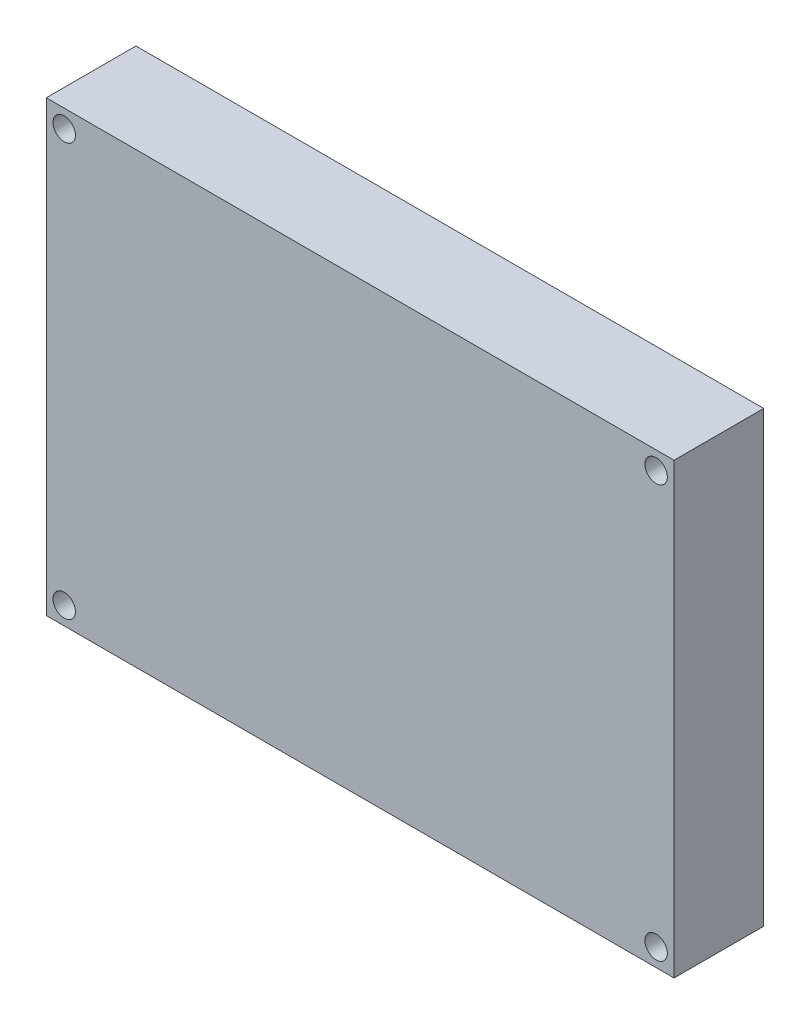
ISO-10303-21;
HEADER;
FILE_DESCRIPTION(('STEP AP214'),'2;1');
FILE_NAME('part.step','',(''),(''),'','','');
FILE_SCHEMA(('AUTOMOTIVE_DESIGN { 1 0 10303 214 1 1 1 1 }'));
ENDSEC;
DATA;
#1=APPLICATION_CONTEXT('core data for automotive mechanical design processes');
#2=APPLICATION_PROTOCOL_DEFINITION('international standard','automotive_design',2000,#1);
#3=PRODUCT_CONTEXT('',#1,'mechanical');
#4=PRODUCT('Part','Part','',(#3));
#5=PRODUCT_RELATED_PRODUCT_CATEGORY('part','',(#4));
#6=PRODUCT_DEFINITION_FORMATION('','',#4);
#7=PRODUCT_DEFINITION_CONTEXT('part definition',#1,'design');
#8=PRODUCT_DEFINITION('design','',#6,#7);
#9=PRODUCT_DEFINITION_SHAPE('','',#8);
#10=(LENGTH_UNIT() NAMED_UNIT(*) SI_UNIT(.MILLI.,.METRE.));
#11=(NAMED_UNIT(*) PLANE_ANGLE_UNIT() SI_UNIT($,.RADIAN.));
#12=(NAMED_UNIT(*) SI_UNIT($,.STERADIAN.) SOLID_ANGLE_UNIT());
#13=UNCERTAINTY_MEASURE_WITH_UNIT(LENGTH_MEASURE(1.E-05),#10,'distance_accuracy_value','');
#14=(GEOMETRIC_REPRESENTATION_CONTEXT(3) GLOBAL_UNCERTAINTY_ASSIGNED_CONTEXT((#13)) GLOBAL_UNIT_ASSIGNED_CONTEXT((#10,
#11,#12)) REPRESENTATION_CONTEXT('',''));
#15=CARTESIAN_POINT('',(0.,0.,0.));
#16=DIRECTION('',(0.,0.,1.));
#17=DIRECTION('',(1.,0.,0.));
#18=AXIS2_PLACEMENT_3D('',#15,#16,#17);
#19=CARTESIAN_POINT('',(35.,25.,10.));
#20=DIRECTION('',(-1.,0.,0.));
#21=DIRECTION('',(0.,0.,1.));
#22=AXIS2_PLACEMENT_3D('',#19,#20,#21);
#23=PLANE('',#22);
#24=DIRECTION('',(0.,1.,0.));
#25=VECTOR('',#24,1.);
#26=CARTESIAN_POINT('',(35.,25.,0.));
#27=LINE('',#26,#25);
#28=CARTESIAN_POINT('',(35.,-25.,0.));
#29=VERTEX_POINT('',#28);
#30=CARTESIAN_POINT('',(35.,25.,0.));
#31=VERTEX_POINT('',#30);
#32=EDGE_CURVE('E98',#29,#31,#27,.T.);
#33=ORIENTED_EDGE('',*,*,#32,.T.);
#34=DIRECTION('',(0.,0.,-1.));
#35=VECTOR('',#34,1.);
#36=CARTESIAN_POINT('',(35.,25.,10.));
#37=LINE('',#36,#35);
#38=CARTESIAN_POINT('',(35.,25.,10.));
#39=VERTEX_POINT('',#38);
#40=EDGE_CURVE('E11',#39,#31,#37,.T.);
#41=ORIENTED_EDGE('',*,*,#40,.F.);
#42=DIRECTION('',(0.,1.,0.));
#43=VECTOR('',#42,1.);
#44=CARTESIAN_POINT('',(35.,25.,10.));
#45=LINE('',#44,#43);
#46=CARTESIAN_POINT('',(35.,-25.,10.));
#47=VERTEX_POINT('',#46);
#48=EDGE_CURVE('E86',#47,#39,#45,.T.);
#49=ORIENTED_EDGE('',*,*,#48,.F.);
#50=DIRECTION('',(0.,0.,-1.));
#51=VECTOR('',#50,1.);
#52=CARTESIAN_POINT('',(35.,-25.,10.));
#53=LINE('',#52,#51);
#54=EDGE_CURVE('E94',#47,#29,#53,.T.);
#55=ORIENTED_EDGE('',*,*,#54,.T.);
#56=EDGE_LOOP('',(#33,#41,#49,#55));
#57=FACE_BOUND('',#56,.T.);
#58=ADVANCED_FACE('F35',(#57),#23,.F.);
#59=CARTESIAN_POINT('',(-35.,25.,10.));
#60=DIRECTION('',(0.,-1.,0.));
#61=DIRECTION('',(0.,0.,-1.));
#62=AXIS2_PLACEMENT_3D('',#59,#60,#61);
#63=PLANE('',#62);
#64=DIRECTION('',(-1.,0.,0.));
#65=VECTOR('',#64,1.);
#66=CARTESIAN_POINT('',(-35.,25.,0.));
#67=LINE('',#66,#65);
#68=CARTESIAN_POINT('',(-35.,25.,0.));
#69=VERTEX_POINT('',#68);
#70=EDGE_CURVE('E90',#31,#69,#67,.T.);
#71=ORIENTED_EDGE('',*,*,#70,.T.);
#72=DIRECTION('',(0.,0.,-1.));
#73=VECTOR('',#72,1.);
#74=CARTESIAN_POINT('',(-35.,25.,10.));
#75=LINE('',#74,#73);
#76=CARTESIAN_POINT('',(-35.,25.,10.));
#77=VERTEX_POINT('',#76);
#78=EDGE_CURVE('E43',#77,#69,#75,.T.);
#79=ORIENTED_EDGE('',*,*,#78,.F.);
#80=DIRECTION('',(-1.,0.,0.));
#81=VECTOR('',#80,1.);
#82=CARTESIAN_POINT('',(-35.,25.,10.));
#83=LINE('',#82,#81);
#84=EDGE_CURVE('E81',#39,#77,#83,.T.);
#85=ORIENTED_EDGE('',*,*,#84,.F.);
#86=ORIENTED_EDGE('',*,*,#40,.T.);
#87=EDGE_LOOP('',(#71,#79,#85,#86));
#88=FACE_BOUND('',#87,.T.);
#89=ADVANCED_FACE('F89',(#88),#63,.F.);
#90=CARTESIAN_POINT('',(-35.,25.,10.));
#91=DIRECTION('',(1.,0.,0.));
#92=DIRECTION('',(0.,0.,-1.));
#93=AXIS2_PLACEMENT_3D('',#90,#91,#92);
#94=PLANE('',#93);
#95=DIRECTION('',(0.,-1.,0.));
#96=VECTOR('',#95,1.);
#97=CARTESIAN_POINT('',(-35.,25.,0.));
#98=LINE('',#97,#96);
#99=CARTESIAN_POINT('',(-35.,-25.,0.));
#100=VERTEX_POINT('',#99);
#101=EDGE_CURVE('E68',#69,#100,#98,.T.);
#102=ORIENTED_EDGE('',*,*,#101,.T.);
#103=DIRECTION('',(0.,0.,-1.));
#104=VECTOR('',#103,1.);
#105=CARTESIAN_POINT('',(-35.,-25.,10.));
#106=LINE('',#105,#104);
#107=CARTESIAN_POINT('',(-35.,-25.,10.));
#108=VERTEX_POINT('',#107);
#109=EDGE_CURVE('E91',#108,#100,#106,.T.);
#110=ORIENTED_EDGE('',*,*,#109,.F.);
#111=DIRECTION('',(0.,-1.,0.));
#112=VECTOR('',#111,1.);
#113=CARTESIAN_POINT('',(-35.,25.,10.));
#114=LINE('',#113,#112);
#115=EDGE_CURVE('E84',#77,#108,#114,.T.);
#116=ORIENTED_EDGE('',*,*,#115,.F.);
#117=ORIENTED_EDGE('',*,*,#78,.T.);
#118=EDGE_LOOP('',(#102,#110,#116,#117));
#119=FACE_BOUND('',#118,.T.);
#120=ADVANCED_FACE('F92',(#119),#94,.F.);
#121=CARTESIAN_POINT('',(-35.,-25.,10.));
#122=DIRECTION('',(0.,1.,0.));
#123=DIRECTION('',(0.,0.,1.));
#124=AXIS2_PLACEMENT_3D('',#121,#122,#123);
#125=PLANE('',#124);
#126=DIRECTION('',(1.,0.,0.));
#127=VECTOR('',#126,1.);
#128=CARTESIAN_POINT('',(-35.,-25.,0.));
#129=LINE('',#128,#127);
#130=EDGE_CURVE('E74',#100,#29,#129,.T.);
#131=ORIENTED_EDGE('',*,*,#130,.T.);
#132=ORIENTED_EDGE('',*,*,#54,.F.);
#133=DIRECTION('',(1.,0.,0.));
#134=VECTOR('',#133,1.);
#135=CARTESIAN_POINT('',(-35.,-25.,10.));
#136=LINE('',#135,#134);
#137=EDGE_CURVE('E51',#108,#47,#136,.T.);
#138=ORIENTED_EDGE('',*,*,#137,.F.);
#139=ORIENTED_EDGE('',*,*,#109,.T.);
#140=EDGE_LOOP('',(#131,#132,#138,#139));
#141=FACE_BOUND('',#140,.T.);
#142=ADVANCED_FACE('F106',(#141),#125,.F.);
#143=CARTESIAN_POINT('',(0.,0.,10.));
#144=DIRECTION('',(0.,0.,1.));
#145=DIRECTION('',(1.,0.,0.));
#146=AXIS2_PLACEMENT_3D('',#143,#144,#145);
#147=PLANE('',#146);
#148=CARTESIAN_POINT('',(-33.,-23.,10.));
#149=DIRECTION('',(0.,0.,1.));
#150=DIRECTION('',(-1.,0.,0.));
#151=AXIS2_PLACEMENT_3D('',#148,#149,#150);
#152=CIRCLE('',#151,1.25);
#153=CARTESIAN_POINT('',(-34.25,-23.,10.));
#154=VERTEX_POINT('',#153);
#155=EDGE_CURVE('E118',#154,#154,#152,.T.);
#156=ORIENTED_EDGE('',*,*,#155,.F.);
#157=EDGE_LOOP('',(#156));
#158=FACE_BOUND('',#157,.T.);
#159=CARTESIAN_POINT('',(33.,-23.,10.));
#160=DIRECTION('',(0.,0.,1.));
#161=DIRECTION('',(1.,0.,0.));
#162=AXIS2_PLACEMENT_3D('',#159,#160,#161);
#163=CIRCLE('',#162,1.25);
#164=CARTESIAN_POINT('',(34.25,-23.,10.));
#165=VERTEX_POINT('',#164);
#166=EDGE_CURVE('E124',#165,#165,#163,.T.);
#167=ORIENTED_EDGE('',*,*,#166,.F.);
#168=EDGE_LOOP('',(#167));
#169=FACE_BOUND('',#168,.T.);
#170=CARTESIAN_POINT('',(33.,23.,10.));
#171=DIRECTION('',(0.,0.,1.));
#172=DIRECTION('',(-1.,0.,0.));
#173=AXIS2_PLACEMENT_3D('',#170,#171,#172);
#174=CIRCLE('',#173,1.25);
#175=CARTESIAN_POINT('',(31.75,23.,10.));
#176=VERTEX_POINT('',#175);
#177=EDGE_CURVE('E130',#176,#176,#174,.T.);
#178=ORIENTED_EDGE('',*,*,#177,.F.);
#179=EDGE_LOOP('',(#178));
#180=FACE_BOUND('',#179,.T.);
#181=CARTESIAN_POINT('',(-33.,23.,10.));
#182=DIRECTION('',(0.,0.,1.));
#183=DIRECTION('',(1.,0.,0.));
#184=AXIS2_PLACEMENT_3D('',#181,#182,#183);
#185=CIRCLE('',#184,1.25);
#186=CARTESIAN_POINT('',(-31.75,23.,10.));
#187=VERTEX_POINT('',#186);
#188=EDGE_CURVE('E112',#187,#187,#185,.T.);
#189=ORIENTED_EDGE('',*,*,#188,.F.);
#190=EDGE_LOOP('',(#189));
#191=FACE_BOUND('',#190,.T.);
#192=ORIENTED_EDGE('',*,*,#48,.T.);
#193=ORIENTED_EDGE('',*,*,#84,.T.);
#194=ORIENTED_EDGE('',*,*,#115,.T.);
#195=ORIENTED_EDGE('',*,*,#137,.T.);
#196=EDGE_LOOP('',(#192,#193,#194,#195));
#197=FACE_BOUND('',#196,.T.);
#198=ADVANCED_FACE('F82',(#158,#169,#180,#191,#197),#147,.T.);
#199=CARTESIAN_POINT('',(0.,0.,0.));
#200=DIRECTION('',(0.,0.,1.));
#201=DIRECTION('',(1.,0.,0.));
#202=AXIS2_PLACEMENT_3D('',#199,#200,#201);
#203=PLANE('',#202);
#204=CARTESIAN_POINT('',(-33.,-23.,0.));
#205=DIRECTION('',(0.,0.,1.));
#206=DIRECTION('',(-1.,0.,0.));
#207=AXIS2_PLACEMENT_3D('',#204,#205,#206);
#208=CIRCLE('',#207,1.25);
#209=CARTESIAN_POINT('',(-34.25,-23.,0.));
#210=VERTEX_POINT('',#209);
#211=EDGE_CURVE('E121',#210,#210,#208,.T.);
#212=ORIENTED_EDGE('',*,*,#211,.T.);
#213=EDGE_LOOP('',(#212));
#214=FACE_BOUND('',#213,.T.);
#215=CARTESIAN_POINT('',(33.,-23.,0.));
#216=DIRECTION('',(0.,0.,1.));
#217=DIRECTION('',(1.,0.,0.));
#218=AXIS2_PLACEMENT_3D('',#215,#216,#217);
#219=CIRCLE('',#218,1.25);
#220=CARTESIAN_POINT('',(34.25,-23.,0.));
#221=VERTEX_POINT('',#220);
#222=EDGE_CURVE('E127',#221,#221,#219,.T.);
#223=ORIENTED_EDGE('',*,*,#222,.T.);
#224=EDGE_LOOP('',(#223));
#225=FACE_BOUND('',#224,.T.);
#226=CARTESIAN_POINT('',(33.,23.,0.));
#227=DIRECTION('',(0.,0.,1.));
#228=DIRECTION('',(-1.,0.,0.));
#229=AXIS2_PLACEMENT_3D('',#226,#227,#228);
#230=CIRCLE('',#229,1.25);
#231=CARTESIAN_POINT('',(31.75,23.,0.));
#232=VERTEX_POINT('',#231);
#233=EDGE_CURVE('E115',#232,#232,#230,.T.);
#234=ORIENTED_EDGE('',*,*,#233,.T.);
#235=EDGE_LOOP('',(#234));
#236=FACE_BOUND('',#235,.T.);
#237=CARTESIAN_POINT('',(-33.,23.,0.));
#238=DIRECTION('',(0.,0.,1.));
#239=DIRECTION('',(1.,0.,0.));
#240=AXIS2_PLACEMENT_3D('',#237,#238,#239);
#241=CIRCLE('',#240,1.25);
#242=CARTESIAN_POINT('',(-31.75,23.,0.));
#243=VERTEX_POINT('',#242);
#244=EDGE_CURVE('E101',#243,#243,#241,.T.);
#245=ORIENTED_EDGE('',*,*,#244,.T.);
#246=EDGE_LOOP('',(#245));
#247=FACE_BOUND('',#246,.T.);
#248=ORIENTED_EDGE('',*,*,#32,.F.);
#249=ORIENTED_EDGE('',*,*,#130,.F.);
#250=ORIENTED_EDGE('',*,*,#101,.F.);
#251=ORIENTED_EDGE('',*,*,#70,.F.);
#252=EDGE_LOOP('',(#248,#249,#250,#251));
#253=FACE_BOUND('',#252,.T.);
#254=ADVANCED_FACE('F109',(#214,#225,#236,#247,#253),#203,.F.);
#255=CARTESIAN_POINT('',(-33.,23.,0.));
#256=DIRECTION('',(0.,0.,1.));
#257=DIRECTION('',(1.,0.,0.));
#258=AXIS2_PLACEMENT_3D('',#255,#256,#257);
#259=CYLINDRICAL_SURFACE('',#258,1.25);
#260=ORIENTED_EDGE('',*,*,#244,.F.);
#261=EDGE_LOOP('',(#260));
#262=FACE_BOUND('',#261,.T.);
#263=ORIENTED_EDGE('',*,*,#188,.T.);
#264=EDGE_LOOP('',(#263));
#265=FACE_BOUND('',#264,.T.);
#266=ADVANCED_FACE('F142',(#262,#265),#259,.F.);
#267=CARTESIAN_POINT('',(33.,23.,0.));
#268=DIRECTION('',(0.,0.,1.));
#269=DIRECTION('',(1.,0.,0.));
#270=AXIS2_PLACEMENT_3D('',#267,#268,#269);
#271=CYLINDRICAL_SURFACE('',#270,1.25);
#272=ORIENTED_EDGE('',*,*,#233,.F.);
#273=EDGE_LOOP('',(#272));
#274=FACE_BOUND('',#273,.T.);
#275=ORIENTED_EDGE('',*,*,#177,.T.);
#276=EDGE_LOOP('',(#275));
#277=FACE_BOUND('',#276,.T.);
#278=ADVANCED_FACE('F138',(#274,#277),#271,.F.);
#279=CARTESIAN_POINT('',(33.,-23.,0.));
#280=DIRECTION('',(0.,0.,1.));
#281=DIRECTION('',(1.,0.,0.));
#282=AXIS2_PLACEMENT_3D('',#279,#280,#281);
#283=CYLINDRICAL_SURFACE('',#282,1.25);
#284=ORIENTED_EDGE('',*,*,#222,.F.);
#285=EDGE_LOOP('',(#284));
#286=FACE_BOUND('',#285,.T.);
#287=ORIENTED_EDGE('',*,*,#166,.T.);
#288=EDGE_LOOP('',(#287));
#289=FACE_BOUND('',#288,.T.);
#290=ADVANCED_FACE('F141',(#286,#289),#283,.F.);
#291=CARTESIAN_POINT('',(-33.,-23.,0.));
#292=DIRECTION('',(0.,0.,1.));
#293=DIRECTION('',(1.,0.,0.));
#294=AXIS2_PLACEMENT_3D('',#291,#292,#293);
#295=CYLINDRICAL_SURFACE('',#294,1.25);
#296=ORIENTED_EDGE('',*,*,#211,.F.);
#297=EDGE_LOOP('',(#296));
#298=FACE_BOUND('',#297,.T.);
#299=ORIENTED_EDGE('',*,*,#155,.T.);
#300=EDGE_LOOP('',(#299));
#301=FACE_BOUND('',#300,.T.);
#302=ADVANCED_FACE('F203',(#298,#301),#295,.F.);
#303=CLOSED_SHELL('',(#58,#89,#120,#142,#198,#254,#266,#278,#290,#302));
#304=MANIFOLD_SOLID_BREP('B2',#303);
#305=ADVANCED_BREP_SHAPE_REPRESENTATION('',(#18,#304),#14);
#306=SHAPE_DEFINITION_REPRESENTATION(#9,#305);
ENDSEC;
END-ISO-10303-21;
